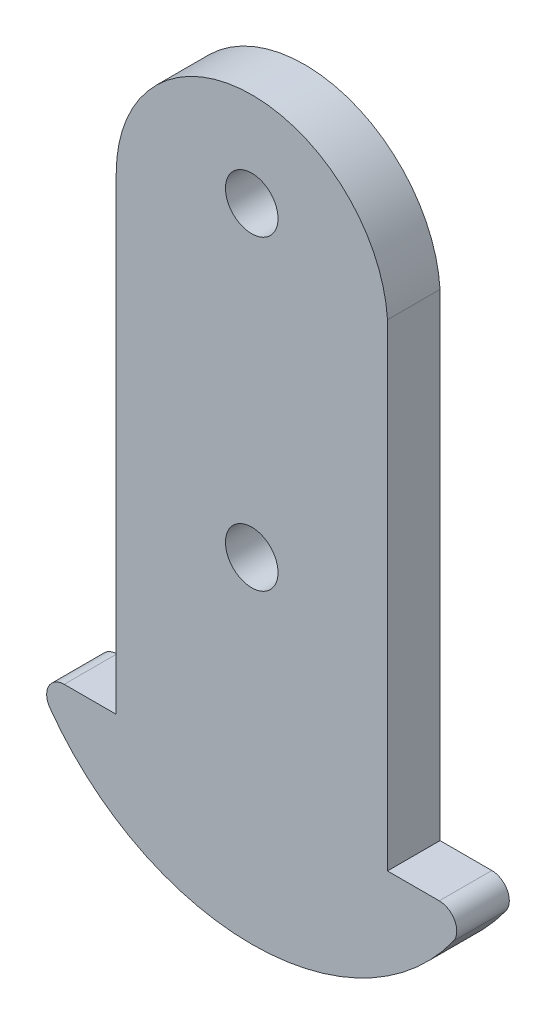
ISO-10303-21;
HEADER;
FILE_DESCRIPTION(('STEP AP214'),'2;1');
FILE_NAME('part.step','',(''),(''),'','','');
FILE_SCHEMA(('AUTOMOTIVE_DESIGN { 1 0 10303 214 1 1 1 1 }'));
ENDSEC;
DATA;
#1=APPLICATION_CONTEXT('core data for automotive mechanical design processes');
#2=APPLICATION_PROTOCOL_DEFINITION('international standard','automotive_design',2000,#1);
#3=PRODUCT_CONTEXT('',#1,'mechanical');
#4=PRODUCT('Part','Part','',(#3));
#5=PRODUCT_RELATED_PRODUCT_CATEGORY('part','',(#4));
#6=PRODUCT_DEFINITION_FORMATION('','',#4);
#7=PRODUCT_DEFINITION_CONTEXT('part definition',#1,'design');
#8=PRODUCT_DEFINITION('design','',#6,#7);
#9=PRODUCT_DEFINITION_SHAPE('','',#8);
#10=(LENGTH_UNIT() NAMED_UNIT(*) SI_UNIT(.MILLI.,.METRE.));
#11=(NAMED_UNIT(*) PLANE_ANGLE_UNIT() SI_UNIT($,.RADIAN.));
#12=(NAMED_UNIT(*) SI_UNIT($,.STERADIAN.) SOLID_ANGLE_UNIT());
#13=UNCERTAINTY_MEASURE_WITH_UNIT(LENGTH_MEASURE(1.E-05),#10,'distance_accuracy_value','');
#14=(GEOMETRIC_REPRESENTATION_CONTEXT(3) GLOBAL_UNCERTAINTY_ASSIGNED_CONTEXT((#13)) GLOBAL_UNIT_ASSIGNED_CONTEXT((#10,
#11,#12)) REPRESENTATION_CONTEXT('',''));
#15=CARTESIAN_POINT('',(0.,0.,0.));
#16=DIRECTION('',(0.,0.,1.));
#17=DIRECTION('',(1.,0.,0.));
#18=AXIS2_PLACEMENT_3D('',#15,#16,#17);
#19=CARTESIAN_POINT('',(7.75000000000001,0.,3.));
#20=DIRECTION('',(1.,0.,0.));
#21=DIRECTION('',(0.,1.,0.));
#22=AXIS2_PLACEMENT_3D('',#19,#20,#21);
#23=PLANE('',#22);
#24=DIRECTION('',(0.,-1.,0.));
#25=VECTOR('',#24,1.);
#26=CARTESIAN_POINT('',(7.75000000000001,0.,0.));
#27=LINE('',#26,#25);
#28=CARTESIAN_POINT('',(7.75000000000001,9.24999999999999,0.));
#29=VERTEX_POINT('',#28);
#30=CARTESIAN_POINT('',(7.75000000000001,-18.,0.));
#31=VERTEX_POINT('',#30);
#32=EDGE_CURVE('E150',#29,#31,#27,.T.);
#33=ORIENTED_EDGE('',*,*,#32,.F.);
#34=DIRECTION('',(0.,0.,-1.));
#35=VECTOR('',#34,1.);
#36=CARTESIAN_POINT('',(7.75000000000001,9.24999999999999,3.));
#37=LINE('',#36,#35);
#38=CARTESIAN_POINT('',(7.75000000000001,9.24999999999999,3.));
#39=VERTEX_POINT('',#38);
#40=EDGE_CURVE('E11',#39,#29,#37,.T.);
#41=ORIENTED_EDGE('',*,*,#40,.F.);
#42=DIRECTION('',(0.,-1.,0.));
#43=VECTOR('',#42,1.);
#44=CARTESIAN_POINT('',(7.75000000000001,0.,3.));
#45=LINE('',#44,#43);
#46=CARTESIAN_POINT('',(7.75000000000001,-18.,3.));
#47=VERTEX_POINT('',#46);
#48=EDGE_CURVE('E258',#39,#47,#45,.T.);
#49=ORIENTED_EDGE('',*,*,#48,.T.);
#50=DIRECTION('',(0.,0.,-1.));
#51=VECTOR('',#50,1.);
#52=CARTESIAN_POINT('',(7.75000000000001,-18.,3.));
#53=LINE('',#52,#51);
#54=EDGE_CURVE('E59',#47,#31,#53,.T.);
#55=ORIENTED_EDGE('',*,*,#54,.T.);
#56=EDGE_LOOP('',(#33,#41,#49,#55));
#57=FACE_BOUND('',#56,.T.);
#58=ADVANCED_FACE('F41',(#57),#23,.T.);
#59=CARTESIAN_POINT('',(0.0161447636975107,8.75001681636629,3.));
#60=DIRECTION('',(0.,0.,-1.));
#61=DIRECTION('',(-1.,0.,0.));
#62=AXIS2_PLACEMENT_3D('',#59,#60,#61);
#63=CYLINDRICAL_SURFACE('',#62,7.75);
#64=CARTESIAN_POINT('',(0.0161447636975107,8.75001681636629,0.));
#65=DIRECTION('',(0.,0.,1.));
#66=DIRECTION('',(1.,0.,0.));
#67=AXIS2_PLACEMENT_3D('',#64,#65,#66);
#68=CIRCLE('',#67,7.75);
#69=CARTESIAN_POINT('',(-7.73385523630249,8.75001681636629,0.));
#70=VERTEX_POINT('',#69);
#71=EDGE_CURVE('E153',#29,#70,#68,.T.);
#72=ORIENTED_EDGE('',*,*,#71,.T.);
#73=DIRECTION('',(0.,0.,-1.));
#74=VECTOR('',#73,1.);
#75=CARTESIAN_POINT('',(-7.73385523630249,8.75001681636629,3.));
#76=LINE('',#75,#74);
#77=CARTESIAN_POINT('',(-7.73385523630249,8.75001681636629,3.));
#78=VERTEX_POINT('',#77);
#79=EDGE_CURVE('E51',#78,#70,#76,.T.);
#80=ORIENTED_EDGE('',*,*,#79,.F.);
#81=CARTESIAN_POINT('',(0.0161447636975107,8.75001681636629,3.));
#82=DIRECTION('',(0.,0.,1.));
#83=DIRECTION('',(1.,0.,0.));
#84=AXIS2_PLACEMENT_3D('',#81,#82,#83);
#85=CIRCLE('',#84,7.75);
#86=EDGE_CURVE('E253',#39,#78,#85,.T.);
#87=ORIENTED_EDGE('',*,*,#86,.F.);
#88=ORIENTED_EDGE('',*,*,#40,.T.);
#89=EDGE_LOOP('',(#72,#80,#87,#88));
#90=FACE_BOUND('',#89,.T.);
#91=ADVANCED_FACE('F196',(#90),#63,.T.);
#92=CARTESIAN_POINT('',(-7.73385523630249,0.,3.));
#93=DIRECTION('',(1.,0.,0.));
#94=DIRECTION('',(0.,1.,0.));
#95=AXIS2_PLACEMENT_3D('',#92,#93,#94);
#96=PLANE('',#95);
#97=DIRECTION('',(0.,-1.,0.));
#98=VECTOR('',#97,1.);
#99=CARTESIAN_POINT('',(-7.73385523630249,0.,0.));
#100=LINE('',#99,#98);
#101=CARTESIAN_POINT('',(-7.73385523630249,-18.,0.));
#102=VERTEX_POINT('',#101);
#103=EDGE_CURVE('E157',#70,#102,#100,.T.);
#104=ORIENTED_EDGE('',*,*,#103,.T.);
#105=DIRECTION('',(0.,0.,-1.));
#106=VECTOR('',#105,1.);
#107=CARTESIAN_POINT('',(-7.73385523630249,-18.,3.));
#108=LINE('',#107,#106);
#109=CARTESIAN_POINT('',(-7.73385523630249,-18.,3.));
#110=VERTEX_POINT('',#109);
#111=EDGE_CURVE('E184',#110,#102,#108,.T.);
#112=ORIENTED_EDGE('',*,*,#111,.F.);
#113=DIRECTION('',(0.,-1.,0.));
#114=VECTOR('',#113,1.);
#115=CARTESIAN_POINT('',(-7.73385523630249,0.,3.));
#116=LINE('',#115,#114);
#117=EDGE_CURVE('E192',#78,#110,#116,.T.);
#118=ORIENTED_EDGE('',*,*,#117,.F.);
#119=ORIENTED_EDGE('',*,*,#79,.T.);
#120=EDGE_LOOP('',(#104,#112,#118,#119));
#121=FACE_BOUND('',#120,.T.);
#122=ADVANCED_FACE('F190',(#121),#96,.F.);
#123=CARTESIAN_POINT('',(0.,-18.,3.));
#124=DIRECTION('',(0.,1.,0.));
#125=DIRECTION('',(0.,0.,1.));
#126=AXIS2_PLACEMENT_3D('',#123,#124,#125);
#127=PLANE('',#126);
#128=DIRECTION('',(1.,0.,0.));
#129=VECTOR('',#128,1.);
#130=CARTESIAN_POINT('',(0.,-18.,0.));
#131=LINE('',#130,#129);
#132=CARTESIAN_POINT('',(-10.7043604822209,-18.,0.));
#133=VERTEX_POINT('',#132);
#134=EDGE_CURVE('E161',#133,#102,#131,.T.);
#135=ORIENTED_EDGE('',*,*,#134,.F.);
#136=DIRECTION('',(0.,0.,-1.));
#137=VECTOR('',#136,1.);
#138=CARTESIAN_POINT('',(-10.7043604822209,-18.,3.));
#139=LINE('',#138,#137);
#140=CARTESIAN_POINT('',(-10.7043604822209,-18.,3.));
#141=VERTEX_POINT('',#140);
#142=EDGE_CURVE('E181',#141,#133,#139,.T.);
#143=ORIENTED_EDGE('',*,*,#142,.F.);
#144=DIRECTION('',(1.,0.,0.));
#145=VECTOR('',#144,1.);
#146=CARTESIAN_POINT('',(0.,-18.,3.));
#147=LINE('',#146,#145);
#148=EDGE_CURVE('E139',#141,#110,#147,.T.);
#149=ORIENTED_EDGE('',*,*,#148,.T.);
#150=ORIENTED_EDGE('',*,*,#111,.T.);
#151=EDGE_LOOP('',(#135,#143,#149,#150));
#152=FACE_BOUND('',#151,.T.);
#153=ADVANCED_FACE('F233',(#152),#127,.T.);
#154=CARTESIAN_POINT('',(-10.7043604822209,-19.,3.));
#155=DIRECTION('',(0.,0.,-1.));
#156=DIRECTION('',(-1.,0.,0.));
#157=AXIS2_PLACEMENT_3D('',#154,#155,#156);
#158=CYLINDRICAL_SURFACE('',#157,1.00000000000003);
#159=CARTESIAN_POINT('',(-10.7043604822209,-19.,0.));
#160=DIRECTION('',(0.,0.,1.));
#161=DIRECTION('',(1.,0.,0.));
#162=AXIS2_PLACEMENT_3D('',#159,#160,#161);
#163=CIRCLE('',#162,1.00000000000003);
#164=CARTESIAN_POINT('',(-11.517349885934,-19.5822784810127,0.));
#165=VERTEX_POINT('',#164);
#166=EDGE_CURVE('E165',#133,#165,#163,.T.);
#167=ORIENTED_EDGE('',*,*,#166,.T.);
#168=DIRECTION('',(0.,0.,-1.));
#169=VECTOR('',#168,1.);
#170=CARTESIAN_POINT('',(-11.517349885934,-19.5822784810127,3.));
#171=LINE('',#170,#169);
#172=CARTESIAN_POINT('',(-11.517349885934,-19.5822784810127,3.));
#173=VERTEX_POINT('',#172);
#174=EDGE_CURVE('E131',#173,#165,#171,.T.);
#175=ORIENTED_EDGE('',*,*,#174,.F.);
#176=CARTESIAN_POINT('',(-10.7043604822209,-19.,3.));
#177=DIRECTION('',(0.,0.,1.));
#178=DIRECTION('',(1.,0.,0.));
#179=AXIS2_PLACEMENT_3D('',#176,#177,#178);
#180=CIRCLE('',#179,1.00000000000003);
#181=EDGE_CURVE('E118',#141,#173,#180,.T.);
#182=ORIENTED_EDGE('',*,*,#181,.F.);
#183=ORIENTED_EDGE('',*,*,#142,.T.);
#184=EDGE_LOOP('',(#167,#175,#182,#183));
#185=FACE_BOUND('',#184,.T.);
#186=ADVANCED_FACE('F237',(#185),#158,.T.);
#187=CARTESIAN_POINT('',(0.,-11.3333333333333,3.));
#188=DIRECTION('',(0.,0.,-1.));
#189=DIRECTION('',(-1.,0.,0.));
#190=AXIS2_PLACEMENT_3D('',#187,#188,#189);
#191=CYLINDRICAL_SURFACE('',#190,14.1666666666667);
#192=CARTESIAN_POINT('',(0.,-11.3333333333333,0.));
#193=DIRECTION('',(0.,0.,1.));
#194=DIRECTION('',(1.,0.,0.));
#195=AXIS2_PLACEMENT_3D('',#192,#193,#194);
#196=CIRCLE('',#195,14.1666666666667);
#197=CARTESIAN_POINT('',(11.517349885934,-19.5822784810127,0.));
#198=VERTEX_POINT('',#197);
#199=EDGE_CURVE('E127',#165,#198,#196,.T.);
#200=ORIENTED_EDGE('',*,*,#199,.T.);
#201=DIRECTION('',(0.,0.,-1.));
#202=VECTOR('',#201,1.);
#203=CARTESIAN_POINT('',(11.517349885934,-19.5822784810127,3.));
#204=LINE('',#203,#202);
#205=CARTESIAN_POINT('',(11.517349885934,-19.5822784810127,3.));
#206=VERTEX_POINT('',#205);
#207=EDGE_CURVE('E125',#206,#198,#204,.T.);
#208=ORIENTED_EDGE('',*,*,#207,.F.);
#209=CARTESIAN_POINT('',(0.,-11.3333333333333,3.));
#210=DIRECTION('',(0.,0.,1.));
#211=DIRECTION('',(1.,0.,0.));
#212=AXIS2_PLACEMENT_3D('',#209,#210,#211);
#213=CIRCLE('',#212,14.1666666666667);
#214=EDGE_CURVE('E109',#173,#206,#213,.T.);
#215=ORIENTED_EDGE('',*,*,#214,.F.);
#216=ORIENTED_EDGE('',*,*,#174,.T.);
#217=EDGE_LOOP('',(#200,#208,#215,#216));
#218=FACE_BOUND('',#217,.T.);
#219=ADVANCED_FACE('F126',(#218),#191,.T.);
#220=CARTESIAN_POINT('',(10.7043604822209,-19.,3.));
#221=DIRECTION('',(0.,0.,-1.));
#222=DIRECTION('',(-1.,0.,0.));
#223=AXIS2_PLACEMENT_3D('',#220,#221,#222);
#224=CYLINDRICAL_SURFACE('',#223,1.00000000000003);
#225=CARTESIAN_POINT('',(10.7043604822209,-19.,0.));
#226=DIRECTION('',(0.,0.,1.));
#227=DIRECTION('',(1.,0.,0.));
#228=AXIS2_PLACEMENT_3D('',#225,#226,#227);
#229=CIRCLE('',#228,1.00000000000003);
#230=CARTESIAN_POINT('',(10.7043604822209,-18.,0.));
#231=VERTEX_POINT('',#230);
#232=EDGE_CURVE('E172',#231,#198,#229,.F.);
#233=ORIENTED_EDGE('',*,*,#232,.F.);
#234=DIRECTION('',(0.,0.,-1.));
#235=VECTOR('',#234,1.);
#236=CARTESIAN_POINT('',(10.7043604822209,-18.,3.));
#237=LINE('',#236,#235);
#238=CARTESIAN_POINT('',(10.7043604822209,-18.,3.));
#239=VERTEX_POINT('',#238);
#240=EDGE_CURVE('E84',#239,#231,#237,.T.);
#241=ORIENTED_EDGE('',*,*,#240,.F.);
#242=CARTESIAN_POINT('',(10.7043604822209,-19.,3.));
#243=DIRECTION('',(0.,0.,1.));
#244=DIRECTION('',(1.,0.,0.));
#245=AXIS2_PLACEMENT_3D('',#242,#243,#244);
#246=CIRCLE('',#245,1.00000000000003);
#247=EDGE_CURVE('E115',#239,#206,#246,.F.);
#248=ORIENTED_EDGE('',*,*,#247,.T.);
#249=ORIENTED_EDGE('',*,*,#207,.T.);
#250=EDGE_LOOP('',(#233,#241,#248,#249));
#251=FACE_BOUND('',#250,.T.);
#252=ADVANCED_FACE('F133',(#251),#224,.T.);
#253=CARTESIAN_POINT('',(0.,-6.375,3.));
#254=DIRECTION('',(0.,0.,-1.));
#255=DIRECTION('',(-1.,0.,0.));
#256=AXIS2_PLACEMENT_3D('',#253,#254,#255);
#257=CYLINDRICAL_SURFACE('',#256,1.5);
#258=CARTESIAN_POINT('',(0.,-6.375,3.));
#259=DIRECTION('',(0.,0.,1.));
#260=DIRECTION('',(1.,0.,0.));
#261=AXIS2_PLACEMENT_3D('',#258,#259,#260);
#262=CIRCLE('',#261,1.5);
#263=CARTESIAN_POINT('',(1.5,-6.375,3.));
#264=VERTEX_POINT('',#263);
#265=EDGE_CURVE('E220',#264,#264,#262,.T.);
#266=ORIENTED_EDGE('',*,*,#265,.T.);
#267=EDGE_LOOP('',(#266));
#268=FACE_BOUND('',#267,.T.);
#269=CARTESIAN_POINT('',(0.,-6.375,0.));
#270=DIRECTION('',(0.,0.,1.));
#271=DIRECTION('',(1.,0.,0.));
#272=AXIS2_PLACEMENT_3D('',#269,#270,#271);
#273=CIRCLE('',#272,1.5);
#274=CARTESIAN_POINT('',(1.5,-6.375,0.));
#275=VERTEX_POINT('',#274);
#276=EDGE_CURVE('E146',#275,#275,#273,.T.);
#277=ORIENTED_EDGE('',*,*,#276,.F.);
#278=EDGE_LOOP('',(#277));
#279=FACE_BOUND('',#278,.T.);
#280=ADVANCED_FACE('F207',(#268,#279),#257,.F.);
#281=CARTESIAN_POINT('',(0.,11.125,3.));
#282=DIRECTION('',(0.,0.,-1.));
#283=DIRECTION('',(-1.,0.,0.));
#284=AXIS2_PLACEMENT_3D('',#281,#282,#283);
#285=CYLINDRICAL_SURFACE('',#284,1.5);
#286=CARTESIAN_POINT('',(0.,11.125,3.));
#287=DIRECTION('',(0.,0.,1.));
#288=DIRECTION('',(1.,0.,0.));
#289=AXIS2_PLACEMENT_3D('',#286,#287,#288);
#290=CIRCLE('',#289,1.5);
#291=CARTESIAN_POINT('',(1.5,11.125,3.));
#292=VERTEX_POINT('',#291);
#293=EDGE_CURVE('E263',#292,#292,#290,.T.);
#294=ORIENTED_EDGE('',*,*,#293,.T.);
#295=EDGE_LOOP('',(#294));
#296=FACE_BOUND('',#295,.T.);
#297=CARTESIAN_POINT('',(0.,11.125,0.));
#298=DIRECTION('',(0.,0.,1.));
#299=DIRECTION('',(1.,0.,0.));
#300=AXIS2_PLACEMENT_3D('',#297,#298,#299);
#301=CIRCLE('',#300,1.5);
#302=CARTESIAN_POINT('',(1.5,11.125,0.));
#303=VERTEX_POINT('',#302);
#304=EDGE_CURVE('E142',#303,#303,#301,.T.);
#305=ORIENTED_EDGE('',*,*,#304,.F.);
#306=EDGE_LOOP('',(#305));
#307=FACE_BOUND('',#306,.T.);
#308=ADVANCED_FACE('F43',(#296,#307),#285,.F.);
#309=EDGE_CURVE('E166',#31,#231,#131,.T.);
#310=ORIENTED_EDGE('',*,*,#309,.F.);
#311=ORIENTED_EDGE('',*,*,#54,.F.);
#312=EDGE_CURVE('E135',#47,#239,#147,.T.);
#313=ORIENTED_EDGE('',*,*,#312,.T.);
#314=ORIENTED_EDGE('',*,*,#240,.T.);
#315=EDGE_LOOP('',(#310,#311,#313,#314));
#316=FACE_BOUND('',#315,.T.);
#317=ADVANCED_FACE('F214',(#316),#127,.T.);
#318=CARTESIAN_POINT('',(0.,0.,3.));
#319=DIRECTION('',(0.,0.,1.));
#320=DIRECTION('',(1.,0.,0.));
#321=AXIS2_PLACEMENT_3D('',#318,#319,#320);
#322=PLANE('',#321);
#323=ORIENTED_EDGE('',*,*,#293,.F.);
#324=EDGE_LOOP('',(#323));
#325=FACE_BOUND('',#324,.T.);
#326=ORIENTED_EDGE('',*,*,#265,.F.);
#327=EDGE_LOOP('',(#326));
#328=FACE_BOUND('',#327,.T.);
#329=ORIENTED_EDGE('',*,*,#48,.F.);
#330=ORIENTED_EDGE('',*,*,#86,.T.);
#331=ORIENTED_EDGE('',*,*,#117,.T.);
#332=ORIENTED_EDGE('',*,*,#148,.F.);
#333=ORIENTED_EDGE('',*,*,#181,.T.);
#334=ORIENTED_EDGE('',*,*,#214,.T.);
#335=ORIENTED_EDGE('',*,*,#247,.F.);
#336=ORIENTED_EDGE('',*,*,#312,.F.);
#337=EDGE_LOOP('',(#329,#330,#331,#332,#333,#334,#335,#336));
#338=FACE_BOUND('',#337,.T.);
#339=ADVANCED_FACE('F112',(#325,#328,#338),#322,.T.);
#340=CARTESIAN_POINT('',(0.,0.,0.));
#341=DIRECTION('',(0.,0.,1.));
#342=DIRECTION('',(1.,0.,0.));
#343=AXIS2_PLACEMENT_3D('',#340,#341,#342);
#344=PLANE('',#343);
#345=ORIENTED_EDGE('',*,*,#304,.T.);
#346=EDGE_LOOP('',(#345));
#347=FACE_BOUND('',#346,.T.);
#348=ORIENTED_EDGE('',*,*,#276,.T.);
#349=EDGE_LOOP('',(#348));
#350=FACE_BOUND('',#349,.T.);
#351=ORIENTED_EDGE('',*,*,#32,.T.);
#352=ORIENTED_EDGE('',*,*,#309,.T.);
#353=ORIENTED_EDGE('',*,*,#232,.T.);
#354=ORIENTED_EDGE('',*,*,#199,.F.);
#355=ORIENTED_EDGE('',*,*,#166,.F.);
#356=ORIENTED_EDGE('',*,*,#134,.T.);
#357=ORIENTED_EDGE('',*,*,#103,.F.);
#358=ORIENTED_EDGE('',*,*,#71,.F.);
#359=EDGE_LOOP('',(#351,#352,#353,#354,#355,#356,#357,#358));
#360=FACE_BOUND('',#359,.T.);
#361=ADVANCED_FACE('F198',(#347,#350,#360),#344,.F.);
#362=CLOSED_SHELL('',(#58,#91,#122,#153,#186,#219,#252,#280,#308,#317,#339,#361));
#363=MANIFOLD_SOLID_BREP('B2',#362);
#364=ADVANCED_BREP_SHAPE_REPRESENTATION('',(#18,#363),#14);
#365=SHAPE_DEFINITION_REPRESENTATION(#9,#364);
ENDSEC;
END-ISO-10303-21;
